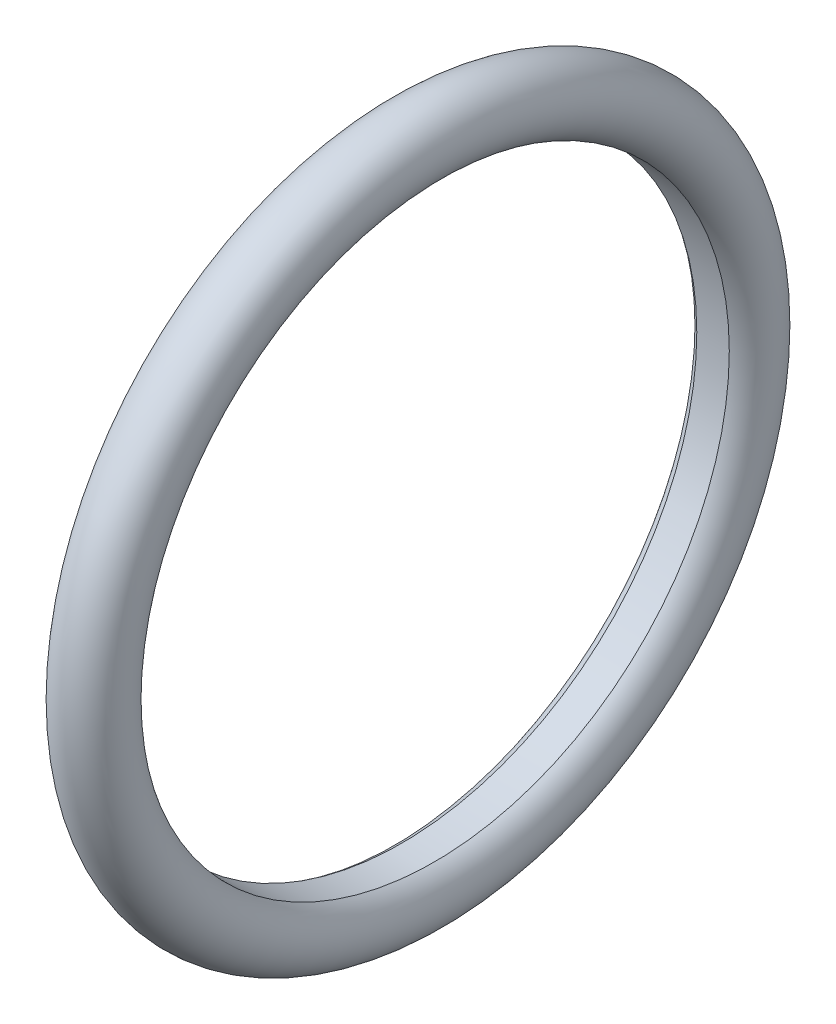
ISO-10303-21;
HEADER;
FILE_DESCRIPTION(('STEP AP214'),'2;1');
FILE_NAME('part.step','',(''),(''),'','','');
FILE_SCHEMA(('AUTOMOTIVE_DESIGN { 1 0 10303 214 1 1 1 1 }'));
ENDSEC;
DATA;
#1=APPLICATION_CONTEXT('core data for automotive mechanical design processes');
#2=APPLICATION_PROTOCOL_DEFINITION('international standard','automotive_design',2000,#1);
#3=PRODUCT_CONTEXT('',#1,'mechanical');
#4=PRODUCT('Part','Part','',(#3));
#5=PRODUCT_RELATED_PRODUCT_CATEGORY('part','',(#4));
#6=PRODUCT_DEFINITION_FORMATION('','',#4);
#7=PRODUCT_DEFINITION_CONTEXT('part definition',#1,'design');
#8=PRODUCT_DEFINITION('design','',#6,#7);
#9=PRODUCT_DEFINITION_SHAPE('','',#8);
#10=(LENGTH_UNIT() NAMED_UNIT(*) SI_UNIT(.MILLI.,.METRE.));
#11=(NAMED_UNIT(*) PLANE_ANGLE_UNIT() SI_UNIT($,.RADIAN.));
#12=(NAMED_UNIT(*) SI_UNIT($,.STERADIAN.) SOLID_ANGLE_UNIT());
#13=UNCERTAINTY_MEASURE_WITH_UNIT(LENGTH_MEASURE(1.E-05),#10,'distance_accuracy_value','');
#14=(GEOMETRIC_REPRESENTATION_CONTEXT(3) GLOBAL_UNCERTAINTY_ASSIGNED_CONTEXT((#13)) GLOBAL_UNIT_ASSIGNED_CONTEXT((#10,
#11,#12)) REPRESENTATION_CONTEXT('',''));
#15=CARTESIAN_POINT('',(0.,0.,0.));
#16=DIRECTION('',(0.,0.,1.));
#17=DIRECTION('',(1.,0.,0.));
#18=AXIS2_PLACEMENT_3D('',#15,#16,#17);
#19=CARTESIAN_POINT('',(0.,0.,0.));
#20=DIRECTION('',(-1.,0.,0.));
#21=DIRECTION('',(0.,0.,1.));
#22=AXIS2_PLACEMENT_3D('',#19,#20,#21);
#23=TOROIDAL_SURFACE('',#22,19.325000244,2.);
#24=CARTESIAN_POINT('',(-0.968245395548024,0.,0.));
#25=DIRECTION('',(1.,0.,0.));
#26=DIRECTION('',(0.,0.,-1.));
#27=AXIS2_PLACEMENT_3D('',#24,#25,#26);
#28=CIRCLE('',#27,17.575);
#29=CARTESIAN_POINT('',(-0.968245395548024,0.,-17.575));
#30=VERTEX_POINT('',#29);
#31=EDGE_CURVE('E10',#30,#30,#28,.T.);
#32=ORIENTED_EDGE('',*,*,#31,.T.);
#33=EDGE_LOOP('',(#32));
#34=FACE_BOUND('',#33,.T.);
#35=CARTESIAN_POINT('',(0.968245395548024,0.,0.));
#36=DIRECTION('',(-1.,0.,0.));
#37=DIRECTION('',(0.,0.,1.));
#38=AXIS2_PLACEMENT_3D('',#35,#36,#37);
#39=CIRCLE('',#38,17.575);
#40=CARTESIAN_POINT('',(0.968245395548024,0.,17.575));
#41=VERTEX_POINT('',#40);
#42=EDGE_CURVE('E37',#41,#41,#39,.T.);
#43=ORIENTED_EDGE('',*,*,#42,.T.);
#44=EDGE_LOOP('',(#43));
#45=FACE_BOUND('',#44,.T.);
#46=ADVANCED_FACE('F31',(#34,#45),#23,.T.);
#47=CARTESIAN_POINT('',(-1.,0.,0.));
#48=DIRECTION('',(1.,0.,0.));
#49=DIRECTION('',(0.,0.,-1.));
#50=AXIS2_PLACEMENT_3D('',#47,#48,#49);
#51=CYLINDRICAL_SURFACE('',#50,17.575);
#52=ORIENTED_EDGE('',*,*,#42,.F.);
#53=EDGE_LOOP('',(#52));
#54=FACE_BOUND('',#53,.T.);
#55=ORIENTED_EDGE('',*,*,#31,.F.);
#56=EDGE_LOOP('',(#55));
#57=FACE_BOUND('',#56,.T.);
#58=ADVANCED_FACE('F44',(#54,#57),#51,.F.);
#59=CLOSED_SHELL('',(#46,#58));
#60=MANIFOLD_SOLID_BREP('B2',#59);
#61=ADVANCED_BREP_SHAPE_REPRESENTATION('',(#18,#60),#14);
#62=SHAPE_DEFINITION_REPRESENTATION(#9,#61);
ENDSEC;
END-ISO-10303-21;
